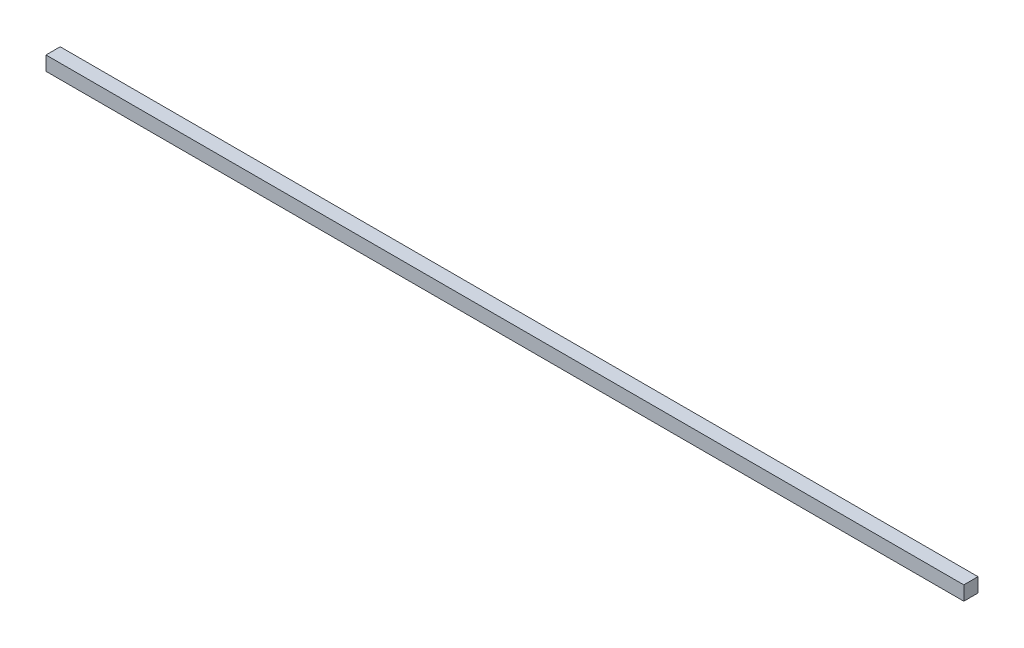
ISO-10303-21;
HEADER;
FILE_DESCRIPTION(('STEP AP214'),'2;1');
FILE_NAME('part.step','',(''),(''),'','','');
FILE_SCHEMA(('AUTOMOTIVE_DESIGN { 1 0 10303 214 1 1 1 1 }'));
ENDSEC;
DATA;
#1=APPLICATION_CONTEXT('core data for automotive mechanical design processes');
#2=APPLICATION_PROTOCOL_DEFINITION('international standard','automotive_design',2000,#1);
#3=PRODUCT_CONTEXT('',#1,'mechanical');
#4=PRODUCT('Part','Part','',(#3));
#5=PRODUCT_RELATED_PRODUCT_CATEGORY('part','',(#4));
#6=PRODUCT_DEFINITION_FORMATION('','',#4);
#7=PRODUCT_DEFINITION_CONTEXT('part definition',#1,'design');
#8=PRODUCT_DEFINITION('design','',#6,#7);
#9=PRODUCT_DEFINITION_SHAPE('','',#8);
#10=(LENGTH_UNIT() NAMED_UNIT(*) SI_UNIT(.MILLI.,.METRE.));
#11=(NAMED_UNIT(*) PLANE_ANGLE_UNIT() SI_UNIT($,.RADIAN.));
#12=(NAMED_UNIT(*) SI_UNIT($,.STERADIAN.) SOLID_ANGLE_UNIT());
#13=UNCERTAINTY_MEASURE_WITH_UNIT(LENGTH_MEASURE(1.E-05),#10,'distance_accuracy_value','');
#14=(GEOMETRIC_REPRESENTATION_CONTEXT(3) GLOBAL_UNCERTAINTY_ASSIGNED_CONTEXT((#13)) GLOBAL_UNIT_ASSIGNED_CONTEXT((#10,
#11,#12)) REPRESENTATION_CONTEXT('',''));
#15=CARTESIAN_POINT('',(0.,0.,0.));
#16=DIRECTION('',(0.,0.,1.));
#17=DIRECTION('',(1.,0.,0.));
#18=AXIS2_PLACEMENT_3D('',#15,#16,#17);
#19=CARTESIAN_POINT('',(-307.975,0.,0.));
#20=DIRECTION('',(0.,-1.,0.));
#21=DIRECTION('',(0.,0.,-1.));
#22=AXIS2_PLACEMENT_3D('',#19,#20,#21);
#23=PLANE('',#22);
#24=DIRECTION('',(0.,0.,-1.));
#25=VECTOR('',#24,1.);
#26=CARTESIAN_POINT('',(0.,0.,0.));
#27=LINE('',#26,#25);
#28=CARTESIAN_POINT('',(0.,0.,0.));
#29=VERTEX_POINT('',#28);
#30=CARTESIAN_POINT('',(0.,0.,-4.7625));
#31=VERTEX_POINT('',#30);
#32=EDGE_CURVE('E106',#29,#31,#27,.T.);
#33=ORIENTED_EDGE('',*,*,#32,.F.);
#34=DIRECTION('',(1.,0.,0.));
#35=VECTOR('',#34,1.);
#36=CARTESIAN_POINT('',(-307.975,0.,0.));
#37=LINE('',#36,#35);
#38=CARTESIAN_POINT('',(-307.975,0.,0.));
#39=VERTEX_POINT('',#38);
#40=EDGE_CURVE('E11',#39,#29,#37,.T.);
#41=ORIENTED_EDGE('',*,*,#40,.F.);
#42=DIRECTION('',(0.,0.,-1.));
#43=VECTOR('',#42,1.);
#44=CARTESIAN_POINT('',(-307.975,0.,0.));
#45=LINE('',#44,#43);
#46=CARTESIAN_POINT('',(-307.975,0.,-4.7625));
#47=VERTEX_POINT('',#46);
#48=EDGE_CURVE('E101',#39,#47,#45,.T.);
#49=ORIENTED_EDGE('',*,*,#48,.T.);
#50=DIRECTION('',(1.,0.,0.));
#51=VECTOR('',#50,1.);
#52=CARTESIAN_POINT('',(-307.975,0.,-4.7625));
#53=LINE('',#52,#51);
#54=EDGE_CURVE('E44',#47,#31,#53,.T.);
#55=ORIENTED_EDGE('',*,*,#54,.T.);
#56=EDGE_LOOP('',(#33,#41,#49,#55));
#57=FACE_BOUND('',#56,.T.);
#58=ADVANCED_FACE('F41',(#57),#23,.T.);
#59=CARTESIAN_POINT('',(-307.975,0.,0.));
#60=DIRECTION('',(0.,0.,-1.));
#61=DIRECTION('',(-1.,0.,0.));
#62=AXIS2_PLACEMENT_3D('',#59,#60,#61);
#63=PLANE('',#62);
#64=DIRECTION('',(0.,1.,0.));
#65=VECTOR('',#64,1.);
#66=CARTESIAN_POINT('',(0.,0.,0.));
#67=LINE('',#66,#65);
#68=CARTESIAN_POINT('',(0.,4.7625,0.));
#69=VERTEX_POINT('',#68);
#70=EDGE_CURVE('E74',#29,#69,#67,.T.);
#71=ORIENTED_EDGE('',*,*,#70,.T.);
#72=DIRECTION('',(1.,0.,0.));
#73=VECTOR('',#72,1.);
#74=CARTESIAN_POINT('',(-307.975,4.7625,0.));
#75=LINE('',#74,#73);
#76=CARTESIAN_POINT('',(-307.975,4.7625,0.));
#77=VERTEX_POINT('',#76);
#78=EDGE_CURVE('E50',#77,#69,#75,.T.);
#79=ORIENTED_EDGE('',*,*,#78,.F.);
#80=DIRECTION('',(0.,1.,0.));
#81=VECTOR('',#80,1.);
#82=CARTESIAN_POINT('',(-307.975,0.,0.));
#83=LINE('',#82,#81);
#84=EDGE_CURVE('E91',#39,#77,#83,.T.);
#85=ORIENTED_EDGE('',*,*,#84,.F.);
#86=ORIENTED_EDGE('',*,*,#40,.T.);
#87=EDGE_LOOP('',(#71,#79,#85,#86));
#88=FACE_BOUND('',#87,.T.);
#89=ADVANCED_FACE('F116',(#88),#63,.F.);
#90=CARTESIAN_POINT('',(-307.975,4.7625,0.));
#91=DIRECTION('',(0.,-1.,0.));
#92=DIRECTION('',(0.,0.,-1.));
#93=AXIS2_PLACEMENT_3D('',#90,#91,#92);
#94=PLANE('',#93);
#95=DIRECTION('',(0.,0.,-1.));
#96=VECTOR('',#95,1.);
#97=CARTESIAN_POINT('',(0.,4.7625,0.));
#98=LINE('',#97,#96);
#99=CARTESIAN_POINT('',(0.,4.7625,-4.7625));
#100=VERTEX_POINT('',#99);
#101=EDGE_CURVE('E98',#69,#100,#98,.T.);
#102=ORIENTED_EDGE('',*,*,#101,.T.);
#103=DIRECTION('',(1.,0.,0.));
#104=VECTOR('',#103,1.);
#105=CARTESIAN_POINT('',(-307.975,4.7625,-4.7625));
#106=LINE('',#105,#104);
#107=CARTESIAN_POINT('',(-307.975,4.7625,-4.7625));
#108=VERTEX_POINT('',#107);
#109=EDGE_CURVE('E95',#108,#100,#106,.T.);
#110=ORIENTED_EDGE('',*,*,#109,.F.);
#111=DIRECTION('',(0.,0.,-1.));
#112=VECTOR('',#111,1.);
#113=CARTESIAN_POINT('',(-307.975,4.7625,0.));
#114=LINE('',#113,#112);
#115=EDGE_CURVE('E86',#77,#108,#114,.T.);
#116=ORIENTED_EDGE('',*,*,#115,.F.);
#117=ORIENTED_EDGE('',*,*,#78,.T.);
#118=EDGE_LOOP('',(#102,#110,#116,#117));
#119=FACE_BOUND('',#118,.T.);
#120=ADVANCED_FACE('F96',(#119),#94,.F.);
#121=CARTESIAN_POINT('',(-307.975,0.,-4.7625));
#122=DIRECTION('',(0.,0.,-1.));
#123=DIRECTION('',(-1.,0.,0.));
#124=AXIS2_PLACEMENT_3D('',#121,#122,#123);
#125=PLANE('',#124);
#126=DIRECTION('',(0.,1.,0.));
#127=VECTOR('',#126,1.);
#128=CARTESIAN_POINT('',(0.,0.,-4.7625));
#129=LINE('',#128,#127);
#130=EDGE_CURVE('E109',#31,#100,#129,.T.);
#131=ORIENTED_EDGE('',*,*,#130,.F.);
#132=ORIENTED_EDGE('',*,*,#54,.F.);
#133=DIRECTION('',(0.,1.,0.));
#134=VECTOR('',#133,1.);
#135=CARTESIAN_POINT('',(-307.975,0.,-4.7625));
#136=LINE('',#135,#134);
#137=EDGE_CURVE('E90',#47,#108,#136,.T.);
#138=ORIENTED_EDGE('',*,*,#137,.T.);
#139=ORIENTED_EDGE('',*,*,#109,.T.);
#140=EDGE_LOOP('',(#131,#132,#138,#139));
#141=FACE_BOUND('',#140,.T.);
#142=ADVANCED_FACE('F100',(#141),#125,.T.);
#143=CARTESIAN_POINT('',(-307.975,0.,0.));
#144=DIRECTION('',(1.,0.,0.));
#145=DIRECTION('',(0.,0.,-1.));
#146=AXIS2_PLACEMENT_3D('',#143,#144,#145);
#147=PLANE('',#146);
#148=ORIENTED_EDGE('',*,*,#48,.F.);
#149=ORIENTED_EDGE('',*,*,#84,.T.);
#150=ORIENTED_EDGE('',*,*,#115,.T.);
#151=ORIENTED_EDGE('',*,*,#137,.F.);
#152=EDGE_LOOP('',(#148,#149,#150,#151));
#153=FACE_BOUND('',#152,.T.);
#154=ADVANCED_FACE('F89',(#153),#147,.F.);
#155=CARTESIAN_POINT('',(0.,0.,0.));
#156=DIRECTION('',(1.,0.,0.));
#157=DIRECTION('',(0.,0.,-1.));
#158=AXIS2_PLACEMENT_3D('',#155,#156,#157);
#159=PLANE('',#158);
#160=ORIENTED_EDGE('',*,*,#32,.T.);
#161=ORIENTED_EDGE('',*,*,#130,.T.);
#162=ORIENTED_EDGE('',*,*,#101,.F.);
#163=ORIENTED_EDGE('',*,*,#70,.F.);
#164=EDGE_LOOP('',(#160,#161,#162,#163));
#165=FACE_BOUND('',#164,.T.);
#166=ADVANCED_FACE('F114',(#165),#159,.T.);
#167=CLOSED_SHELL('',(#58,#89,#120,#142,#154,#166));
#168=MANIFOLD_SOLID_BREP('B2',#167);
#169=ADVANCED_BREP_SHAPE_REPRESENTATION('',(#18,#168),#14);
#170=SHAPE_DEFINITION_REPRESENTATION(#9,#169);
ENDSEC;
END-ISO-10303-21;
